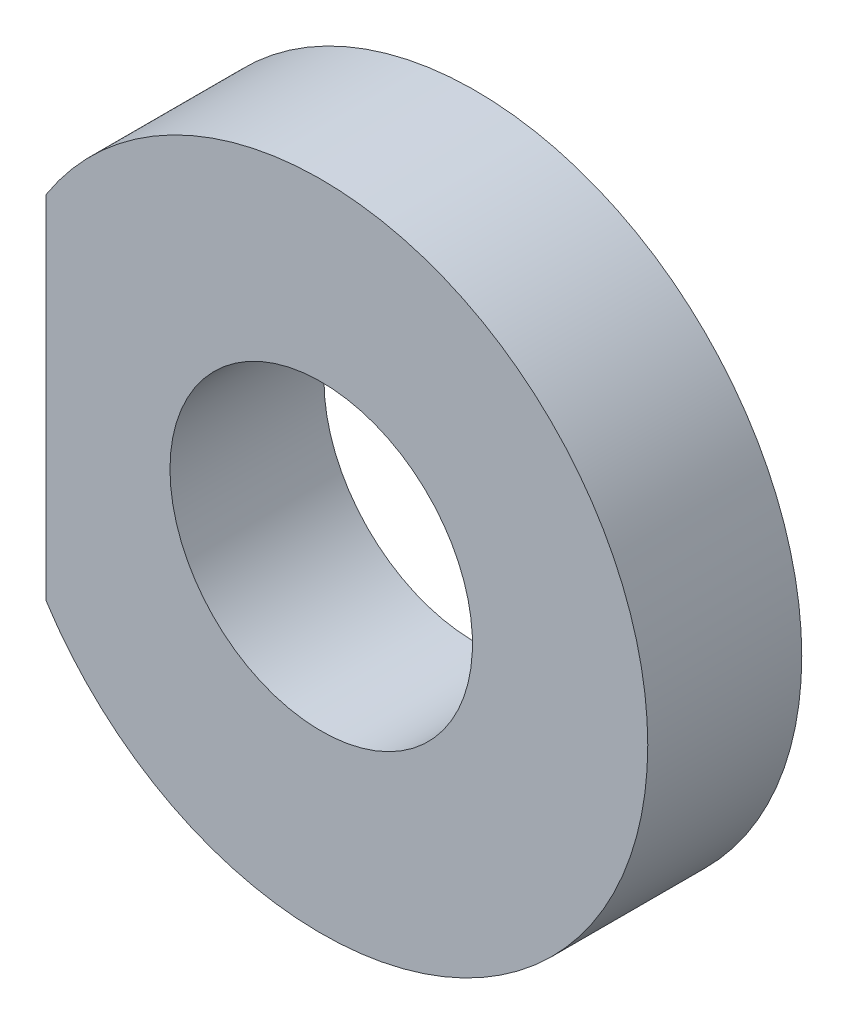
ISO-10303-21;
HEADER;
FILE_DESCRIPTION(('STEP AP214'),'2;1');
FILE_NAME('part.step','',(''),(''),'','','');
FILE_SCHEMA(('AUTOMOTIVE_DESIGN { 1 0 10303 214 1 1 1 1 }'));
ENDSEC;
DATA;
#1=APPLICATION_CONTEXT('core data for automotive mechanical design processes');
#2=APPLICATION_PROTOCOL_DEFINITION('international standard','automotive_design',2000,#1);
#3=PRODUCT_CONTEXT('',#1,'mechanical');
#4=PRODUCT('Part','Part','',(#3));
#5=PRODUCT_RELATED_PRODUCT_CATEGORY('part','',(#4));
#6=PRODUCT_DEFINITION_FORMATION('','',#4);
#7=PRODUCT_DEFINITION_CONTEXT('part definition',#1,'design');
#8=PRODUCT_DEFINITION('design','',#6,#7);
#9=PRODUCT_DEFINITION_SHAPE('','',#8);
#10=(LENGTH_UNIT() NAMED_UNIT(*) SI_UNIT(.MILLI.,.METRE.));
#11=(NAMED_UNIT(*) PLANE_ANGLE_UNIT() SI_UNIT($,.RADIAN.));
#12=(NAMED_UNIT(*) SI_UNIT($,.STERADIAN.) SOLID_ANGLE_UNIT());
#13=UNCERTAINTY_MEASURE_WITH_UNIT(LENGTH_MEASURE(1.E-05),#10,'distance_accuracy_value','');
#14=(GEOMETRIC_REPRESENTATION_CONTEXT(3) GLOBAL_UNCERTAINTY_ASSIGNED_CONTEXT((#13)) GLOBAL_UNIT_ASSIGNED_CONTEXT((#10,
#11,#12)) REPRESENTATION_CONTEXT('',''));
#15=CARTESIAN_POINT('',(0.,0.,0.));
#16=DIRECTION('',(0.,0.,1.));
#17=DIRECTION('',(1.,0.,0.));
#18=AXIS2_PLACEMENT_3D('',#15,#16,#17);
#19=CARTESIAN_POINT('',(-10.5,0.,-1.));
#20=DIRECTION('',(0.,0.,-1.));
#21=DIRECTION('',(1.,0.,0.));
#22=AXIS2_PLACEMENT_3D('',#19,#20,#21);
#23=CYLINDRICAL_SURFACE('',#22,1.1);
#24=CARTESIAN_POINT('',(-10.5,0.,-2.12));
#25=DIRECTION('',(0.,0.,1.));
#26=DIRECTION('',(1.,0.,0.));
#27=AXIS2_PLACEMENT_3D('',#24,#25,#26);
#28=CIRCLE('',#27,1.1);
#29=CARTESIAN_POINT('',(-11.6,0.,-2.12));
#30=VERTEX_POINT('',#29);
#31=EDGE_CURVE('E62',#30,#30,#28,.T.);
#32=ORIENTED_EDGE('',*,*,#31,.F.);
#33=DIRECTION('',(0.,0.,1.));
#34=VECTOR('',#33,1.);
#35=CARTESIAN_POINT('',(-11.6,0.,-1.));
#36=LINE('',#35,#34);
#37=CARTESIAN_POINT('',(-11.6,0.,-1.));
#38=VERTEX_POINT('',#37);
#39=EDGE_CURVE('E11',#30,#38,#36,.T.);
#40=ORIENTED_EDGE('',*,*,#39,.T.);
#41=CARTESIAN_POINT('',(-10.5,0.,-1.));
#42=DIRECTION('',(0.,0.,-1.));
#43=DIRECTION('',(1.,0.,0.));
#44=AXIS2_PLACEMENT_3D('',#41,#42,#43);
#45=CIRCLE('',#44,1.1);
#46=EDGE_CURVE('E63',#38,#38,#45,.T.);
#47=ORIENTED_EDGE('',*,*,#46,.F.);
#48=ORIENTED_EDGE('',*,*,#39,.F.);
#49=EDGE_LOOP('',(#32,#40,#47,#48));
#50=FACE_BOUND('',#49,.T.);
#51=ADVANCED_FACE('F16',(#50),#23,.F.);
#52=CARTESIAN_POINT('',(-12.5,-1.28086884574496,-1.));
#53=DIRECTION('',(-1.,0.,0.));
#54=DIRECTION('',(0.,0.,1.));
#55=AXIS2_PLACEMENT_3D('',#52,#53,#54);
#56=PLANE('',#55);
#57=DIRECTION('',(0.,1.,0.));
#58=VECTOR('',#57,1.);
#59=CARTESIAN_POINT('',(-12.5,-7.362,-1.));
#60=LINE('',#59,#58);
#61=CARTESIAN_POINT('',(-12.5,-1.28086884574496,-1.));
#62=VERTEX_POINT('',#61);
#63=CARTESIAN_POINT('',(-12.5,1.28086884574495,-1.));
#64=VERTEX_POINT('',#63);
#65=EDGE_CURVE('E76',#62,#64,#60,.T.);
#66=ORIENTED_EDGE('',*,*,#65,.T.);
#67=DIRECTION('',(0.,0.,-1.));
#68=VECTOR('',#67,1.);
#69=CARTESIAN_POINT('',(-12.5,1.28086884574495,-1.));
#70=LINE('',#69,#68);
#71=CARTESIAN_POINT('',(-12.5,1.28086884574495,-2.12));
#72=VERTEX_POINT('',#71);
#73=EDGE_CURVE('E27',#64,#72,#70,.T.);
#74=ORIENTED_EDGE('',*,*,#73,.T.);
#75=DIRECTION('',(0.,1.,0.));
#76=VECTOR('',#75,1.);
#77=CARTESIAN_POINT('',(-12.5,-7.362,-2.12));
#78=LINE('',#77,#76);
#79=CARTESIAN_POINT('',(-12.5,-1.28086884574496,-2.12));
#80=VERTEX_POINT('',#79);
#81=EDGE_CURVE('E67',#80,#72,#78,.T.);
#82=ORIENTED_EDGE('',*,*,#81,.F.);
#83=DIRECTION('',(0.,0.,-1.));
#84=VECTOR('',#83,1.);
#85=CARTESIAN_POINT('',(-12.5,-1.28086884574496,-1.));
#86=LINE('',#85,#84);
#87=EDGE_CURVE('E57',#62,#80,#86,.T.);
#88=ORIENTED_EDGE('',*,*,#87,.F.);
#89=EDGE_LOOP('',(#66,#74,#82,#88));
#90=FACE_BOUND('',#89,.T.);
#91=ADVANCED_FACE('F96',(#90),#56,.T.);
#92=CARTESIAN_POINT('',(-10.5,0.,-1.));
#93=DIRECTION('',(0.,0.,-1.));
#94=DIRECTION('',(1.,0.,0.));
#95=AXIS2_PLACEMENT_3D('',#92,#93,#94);
#96=CYLINDRICAL_SURFACE('',#95,2.375);
#97=CARTESIAN_POINT('',(-10.5,0.,-1.));
#98=DIRECTION('',(0.,0.,1.));
#99=DIRECTION('',(-0.842105263157893,-0.539313198208402,0.));
#100=AXIS2_PLACEMENT_3D('',#97,#98,#99);
#101=CIRCLE('',#100,2.375);
#102=EDGE_CURVE('E20',#62,#64,#101,.T.);
#103=ORIENTED_EDGE('',*,*,#102,.F.);
#104=ORIENTED_EDGE('',*,*,#87,.T.);
#105=CARTESIAN_POINT('',(-10.5,0.,-2.12));
#106=DIRECTION('',(0.,0.,-1.));
#107=DIRECTION('',(-0.842105263157893,-0.539313198208402,0.));
#108=AXIS2_PLACEMENT_3D('',#105,#106,#107);
#109=CIRCLE('',#108,2.375);
#110=EDGE_CURVE('E79',#72,#80,#109,.T.);
#111=ORIENTED_EDGE('',*,*,#110,.F.);
#112=ORIENTED_EDGE('',*,*,#73,.F.);
#113=EDGE_LOOP('',(#103,#104,#111,#112));
#114=FACE_BOUND('',#113,.T.);
#115=ADVANCED_FACE('F101',(#114),#96,.T.);
#116=CARTESIAN_POINT('',(-10.3125,0.,-1.));
#117=DIRECTION('',(0.,0.,1.));
#118=DIRECTION('',(1.,0.,0.));
#119=AXIS2_PLACEMENT_3D('',#116,#117,#118);
#120=PLANE('',#119);
#121=ORIENTED_EDGE('',*,*,#46,.T.);
#122=EDGE_LOOP('',(#121));
#123=FACE_BOUND('',#122,.T.);
#124=ORIENTED_EDGE('',*,*,#102,.T.);
#125=ORIENTED_EDGE('',*,*,#65,.F.);
#126=EDGE_LOOP('',(#124,#125));
#127=FACE_BOUND('',#126,.T.);
#128=ADVANCED_FACE('F146',(#123,#127),#120,.T.);
#129=CARTESIAN_POINT('',(-10.3125,0.,-2.12));
#130=DIRECTION('',(0.,0.,1.));
#131=DIRECTION('',(1.,0.,0.));
#132=AXIS2_PLACEMENT_3D('',#129,#130,#131);
#133=PLANE('',#132);
#134=ORIENTED_EDGE('',*,*,#31,.T.);
#135=EDGE_LOOP('',(#134));
#136=FACE_BOUND('',#135,.T.);
#137=ORIENTED_EDGE('',*,*,#110,.T.);
#138=ORIENTED_EDGE('',*,*,#81,.T.);
#139=EDGE_LOOP('',(#137,#138));
#140=FACE_BOUND('',#139,.T.);
#141=ADVANCED_FACE('F18',(#136,#140),#133,.F.);
#142=CLOSED_SHELL('',(#51,#91,#115,#128,#141));
#143=MANIFOLD_SOLID_BREP('B1',#142);
#144=ADVANCED_BREP_SHAPE_REPRESENTATION('',(#18,#143),#14);
#145=SHAPE_DEFINITION_REPRESENTATION(#9,#144);
ENDSEC;
END-ISO-10303-21;
